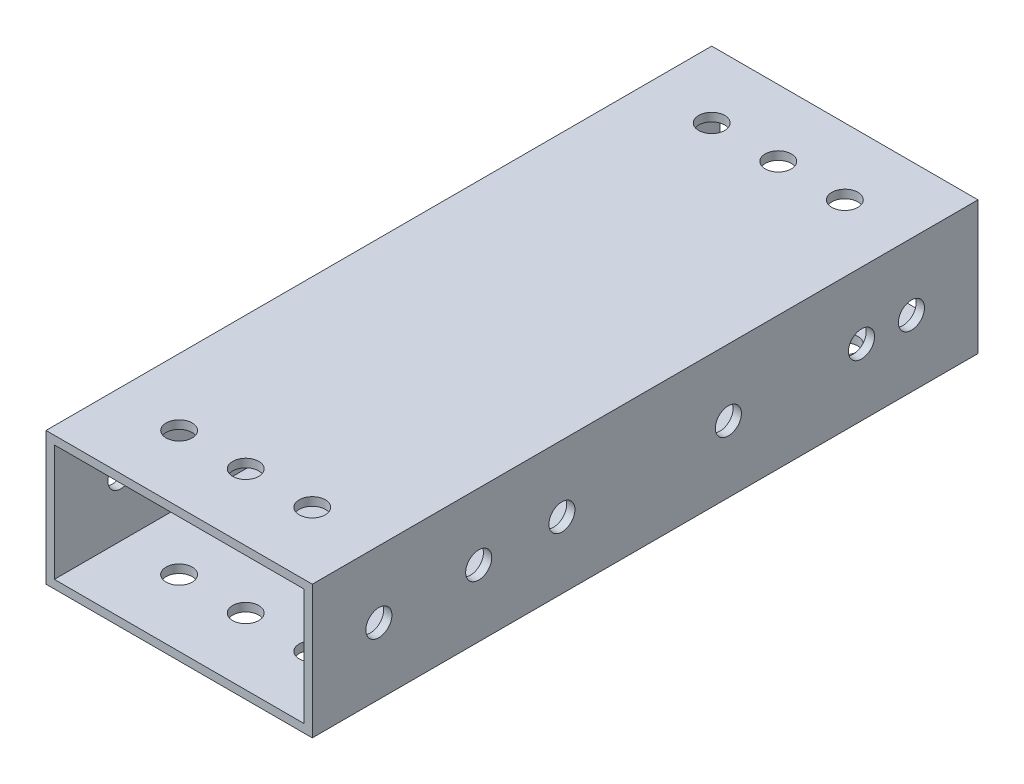
ISO-10303-21;
HEADER;
FILE_DESCRIPTION(('STEP AP214'),'2;1');
FILE_NAME('part.step','',(''),(''),'','','');
FILE_SCHEMA(('AUTOMOTIVE_DESIGN { 1 0 10303 214 1 1 1 1 }'));
ENDSEC;
DATA;
#1=APPLICATION_CONTEXT('core data for automotive mechanical design processes');
#2=APPLICATION_PROTOCOL_DEFINITION('international standard','automotive_design',2000,#1);
#3=PRODUCT_CONTEXT('',#1,'mechanical');
#4=PRODUCT('Part','Part','',(#3));
#5=PRODUCT_RELATED_PRODUCT_CATEGORY('part','',(#4));
#6=PRODUCT_DEFINITION_FORMATION('','',#4);
#7=PRODUCT_DEFINITION_CONTEXT('part definition',#1,'design');
#8=PRODUCT_DEFINITION('design','',#6,#7);
#9=PRODUCT_DEFINITION_SHAPE('','',#8);
#10=(LENGTH_UNIT() NAMED_UNIT(*) SI_UNIT(.MILLI.,.METRE.));
#11=(NAMED_UNIT(*) PLANE_ANGLE_UNIT() SI_UNIT($,.RADIAN.));
#12=(NAMED_UNIT(*) SI_UNIT($,.STERADIAN.) SOLID_ANGLE_UNIT());
#13=UNCERTAINTY_MEASURE_WITH_UNIT(LENGTH_MEASURE(1.E-05),#10,'distance_accuracy_value','');
#14=(GEOMETRIC_REPRESENTATION_CONTEXT(3) GLOBAL_UNCERTAINTY_ASSIGNED_CONTEXT((#13)) GLOBAL_UNIT_ASSIGNED_CONTEXT((#10,
#11,#12)) REPRESENTATION_CONTEXT('',''));
#15=CARTESIAN_POINT('',(0.,0.,0.));
#16=DIRECTION('',(0.,0.,1.));
#17=DIRECTION('',(1.,0.,0.));
#18=AXIS2_PLACEMENT_3D('',#15,#16,#17);
#19=CARTESIAN_POINT('',(0.,0.,63.5));
#20=DIRECTION('',(0.,0.,-1.));
#21=DIRECTION('',(-1.,0.,0.));
#22=AXIS2_PLACEMENT_3D('',#19,#20,#21);
#23=PLANE('',#22);
#24=DIRECTION('',(0.,1.,0.));
#25=VECTOR('',#24,1.);
#26=CARTESIAN_POINT('',(25.4,-12.7,63.5));
#27=LINE('',#26,#25);
#28=CARTESIAN_POINT('',(25.4,-12.7,63.5));
#29=VERTEX_POINT('',#28);
#30=CARTESIAN_POINT('',(25.4,12.7,63.5));
#31=VERTEX_POINT('',#30);
#32=EDGE_CURVE('E153',#29,#31,#27,.T.);
#33=ORIENTED_EDGE('',*,*,#32,.T.);
#34=DIRECTION('',(-1.,0.,0.));
#35=VECTOR('',#34,1.);
#36=CARTESIAN_POINT('',(-25.4,12.7,63.5));
#37=LINE('',#36,#35);
#38=CARTESIAN_POINT('',(-25.4,12.7,63.5));
#39=VERTEX_POINT('',#38);
#40=EDGE_CURVE('E156',#31,#39,#37,.T.);
#41=ORIENTED_EDGE('',*,*,#40,.T.);
#42=DIRECTION('',(0.,-1.,0.));
#43=VECTOR('',#42,1.);
#44=CARTESIAN_POINT('',(-25.4,-12.7,63.5));
#45=LINE('',#44,#43);
#46=CARTESIAN_POINT('',(-25.4,-12.7,63.5));
#47=VERTEX_POINT('',#46);
#48=EDGE_CURVE('E159',#39,#47,#45,.T.);
#49=ORIENTED_EDGE('',*,*,#48,.T.);
#50=DIRECTION('',(1.,0.,0.));
#51=VECTOR('',#50,1.);
#52=CARTESIAN_POINT('',(-25.4,-12.7,63.5));
#53=LINE('',#52,#51);
#54=EDGE_CURVE('E161',#47,#29,#53,.T.);
#55=ORIENTED_EDGE('',*,*,#54,.T.);
#56=EDGE_LOOP('',(#33,#41,#49,#55));
#57=FACE_BOUND('',#56,.T.);
#58=DIRECTION('',(0.,-1.,0.));
#59=VECTOR('',#58,1.);
#60=CARTESIAN_POINT('',(-23.8125,-11.1125,63.5));
#61=LINE('',#60,#59);
#62=CARTESIAN_POINT('',(-23.8125,11.1125,63.5));
#63=VERTEX_POINT('',#62);
#64=CARTESIAN_POINT('',(-23.8125,-11.1125,63.5));
#65=VERTEX_POINT('',#64);
#66=EDGE_CURVE('E115',#63,#65,#61,.T.);
#67=ORIENTED_EDGE('',*,*,#66,.F.);
#68=DIRECTION('',(-1.,0.,0.));
#69=VECTOR('',#68,1.);
#70=CARTESIAN_POINT('',(-23.8125,11.1125,63.5));
#71=LINE('',#70,#69);
#72=CARTESIAN_POINT('',(23.8125,11.1125,63.5));
#73=VERTEX_POINT('',#72);
#74=EDGE_CURVE('E137',#73,#63,#71,.T.);
#75=ORIENTED_EDGE('',*,*,#74,.F.);
#76=DIRECTION('',(0.,1.,0.));
#77=VECTOR('',#76,1.);
#78=CARTESIAN_POINT('',(23.8125,-11.1125,63.5));
#79=LINE('',#78,#77);
#80=CARTESIAN_POINT('',(23.8125,-11.1125,63.5));
#81=VERTEX_POINT('',#80);
#82=EDGE_CURVE('E135',#81,#73,#79,.T.);
#83=ORIENTED_EDGE('',*,*,#82,.F.);
#84=DIRECTION('',(1.,0.,0.));
#85=VECTOR('',#84,1.);
#86=CARTESIAN_POINT('',(-23.8125,-11.1125,63.5));
#87=LINE('',#86,#85);
#88=EDGE_CURVE('E123',#65,#81,#87,.T.);
#89=ORIENTED_EDGE('',*,*,#88,.F.);
#90=EDGE_LOOP('',(#67,#75,#83,#89));
#91=FACE_BOUND('',#90,.T.);
#92=ADVANCED_FACE('F48',(#57,#91),#23,.F.);
#93=CARTESIAN_POINT('',(0.,0.,-63.5));
#94=DIRECTION('',(0.,0.,-1.));
#95=DIRECTION('',(-1.,0.,0.));
#96=AXIS2_PLACEMENT_3D('',#93,#94,#95);
#97=PLANE('',#96);
#98=DIRECTION('',(0.,1.,0.));
#99=VECTOR('',#98,1.);
#100=CARTESIAN_POINT('',(25.4,-12.7,-63.5));
#101=LINE('',#100,#99);
#102=CARTESIAN_POINT('',(25.4,-12.7,-63.5));
#103=VERTEX_POINT('',#102);
#104=CARTESIAN_POINT('',(25.4,12.7,-63.5));
#105=VERTEX_POINT('',#104);
#106=EDGE_CURVE('E131',#103,#105,#101,.T.);
#107=ORIENTED_EDGE('',*,*,#106,.F.);
#108=DIRECTION('',(1.,0.,0.));
#109=VECTOR('',#108,1.);
#110=CARTESIAN_POINT('',(-25.4,-12.7,-63.5));
#111=LINE('',#110,#109);
#112=CARTESIAN_POINT('',(-25.4,-12.7,-63.5));
#113=VERTEX_POINT('',#112);
#114=EDGE_CURVE('E157',#113,#103,#111,.T.);
#115=ORIENTED_EDGE('',*,*,#114,.F.);
#116=DIRECTION('',(0.,-1.,0.));
#117=VECTOR('',#116,1.);
#118=CARTESIAN_POINT('',(-25.4,-12.7,-63.5));
#119=LINE('',#118,#117);
#120=CARTESIAN_POINT('',(-25.4,12.7,-63.5));
#121=VERTEX_POINT('',#120);
#122=EDGE_CURVE('E168',#121,#113,#119,.T.);
#123=ORIENTED_EDGE('',*,*,#122,.F.);
#124=DIRECTION('',(-1.,0.,0.));
#125=VECTOR('',#124,1.);
#126=CARTESIAN_POINT('',(-25.4,12.7,-63.5));
#127=LINE('',#126,#125);
#128=EDGE_CURVE('E166',#105,#121,#127,.T.);
#129=ORIENTED_EDGE('',*,*,#128,.F.);
#130=EDGE_LOOP('',(#107,#115,#123,#129));
#131=FACE_BOUND('',#130,.T.);
#132=DIRECTION('',(-1.,0.,0.));
#133=VECTOR('',#132,1.);
#134=CARTESIAN_POINT('',(-23.8125,11.1125,-63.5));
#135=LINE('',#134,#133);
#136=CARTESIAN_POINT('',(23.8125,11.1125,-63.5));
#137=VERTEX_POINT('',#136);
#138=CARTESIAN_POINT('',(-23.8125,11.1125,-63.5));
#139=VERTEX_POINT('',#138);
#140=EDGE_CURVE('E124',#137,#139,#135,.T.);
#141=ORIENTED_EDGE('',*,*,#140,.T.);
#142=DIRECTION('',(0.,-1.,0.));
#143=VECTOR('',#142,1.);
#144=CARTESIAN_POINT('',(-23.8125,-11.1125,-63.5));
#145=LINE('',#144,#143);
#146=CARTESIAN_POINT('',(-23.8125,-11.1125,-63.5));
#147=VERTEX_POINT('',#146);
#148=EDGE_CURVE('E73',#139,#147,#145,.T.);
#149=ORIENTED_EDGE('',*,*,#148,.T.);
#150=DIRECTION('',(1.,0.,0.));
#151=VECTOR('',#150,1.);
#152=CARTESIAN_POINT('',(-23.8125,-11.1125,-63.5));
#153=LINE('',#152,#151);
#154=CARTESIAN_POINT('',(23.8125,-11.1125,-63.5));
#155=VERTEX_POINT('',#154);
#156=EDGE_CURVE('E130',#147,#155,#153,.T.);
#157=ORIENTED_EDGE('',*,*,#156,.T.);
#158=DIRECTION('',(0.,1.,0.));
#159=VECTOR('',#158,1.);
#160=CARTESIAN_POINT('',(23.8125,-11.1125,-63.5));
#161=LINE('',#160,#159);
#162=EDGE_CURVE('E145',#155,#137,#161,.T.);
#163=ORIENTED_EDGE('',*,*,#162,.T.);
#164=EDGE_LOOP('',(#141,#149,#157,#163));
#165=FACE_BOUND('',#164,.T.);
#166=ADVANCED_FACE('F324',(#131,#165),#97,.T.);
#167=CARTESIAN_POINT('',(25.4,-12.7,63.5));
#168=DIRECTION('',(-1.,0.,0.));
#169=DIRECTION('',(0.,0.,1.));
#170=AXIS2_PLACEMENT_3D('',#167,#168,#169);
#171=PLANE('',#170);
#172=CARTESIAN_POINT('',(25.4,0.,50.8));
#173=DIRECTION('',(1.,0.,0.));
#174=DIRECTION('',(0.,0.,1.));
#175=AXIS2_PLACEMENT_3D('',#172,#173,#174);
#176=CIRCLE('',#175,2.4892);
#177=CARTESIAN_POINT('',(25.4,0.,53.2892));
#178=VERTEX_POINT('',#177);
#179=EDGE_CURVE('E425',#178,#178,#176,.T.);
#180=ORIENTED_EDGE('',*,*,#179,.F.);
#181=EDGE_LOOP('',(#180));
#182=FACE_BOUND('',#181,.T.);
#183=CARTESIAN_POINT('',(25.4,0.,-15.875));
#184=DIRECTION('',(1.,0.,0.));
#185=DIRECTION('',(0.,0.,-1.));
#186=AXIS2_PLACEMENT_3D('',#183,#184,#185);
#187=CIRCLE('',#186,2.4892);
#188=CARTESIAN_POINT('',(25.4,0.,-18.3642));
#189=VERTEX_POINT('',#188);
#190=EDGE_CURVE('E435',#189,#189,#187,.T.);
#191=ORIENTED_EDGE('',*,*,#190,.F.);
#192=EDGE_LOOP('',(#191));
#193=FACE_BOUND('',#192,.T.);
#194=CARTESIAN_POINT('',(25.4,0.,31.75));
#195=DIRECTION('',(1.,0.,0.));
#196=DIRECTION('',(0.,0.,-1.));
#197=AXIS2_PLACEMENT_3D('',#194,#195,#196);
#198=CIRCLE('',#197,2.4892);
#199=CARTESIAN_POINT('',(25.4,0.,29.2608));
#200=VERTEX_POINT('',#199);
#201=EDGE_CURVE('E452',#200,#200,#198,.T.);
#202=ORIENTED_EDGE('',*,*,#201,.F.);
#203=EDGE_LOOP('',(#202));
#204=FACE_BOUND('',#203,.T.);
#205=CARTESIAN_POINT('',(25.4,0.,-50.8));
#206=DIRECTION('',(1.,0.,0.));
#207=DIRECTION('',(0.,0.,-1.));
#208=AXIS2_PLACEMENT_3D('',#205,#206,#207);
#209=CIRCLE('',#208,2.4892);
#210=CARTESIAN_POINT('',(25.4,0.,-53.2892));
#211=VERTEX_POINT('',#210);
#212=EDGE_CURVE('E441',#211,#211,#209,.T.);
#213=ORIENTED_EDGE('',*,*,#212,.F.);
#214=EDGE_LOOP('',(#213));
#215=FACE_BOUND('',#214,.T.);
#216=CARTESIAN_POINT('',(25.4,0.,15.875));
#217=DIRECTION('',(1.,0.,0.));
#218=DIRECTION('',(0.,0.,-1.));
#219=AXIS2_PLACEMENT_3D('',#216,#217,#218);
#220=CIRCLE('',#219,2.4892);
#221=CARTESIAN_POINT('',(25.4,0.,13.3858));
#222=VERTEX_POINT('',#221);
#223=EDGE_CURVE('E442',#222,#222,#220,.T.);
#224=ORIENTED_EDGE('',*,*,#223,.F.);
#225=EDGE_LOOP('',(#224));
#226=FACE_BOUND('',#225,.T.);
#227=CARTESIAN_POINT('',(25.4,0.,-41.275));
#228=DIRECTION('',(1.,0.,0.));
#229=DIRECTION('',(0.,0.,-1.));
#230=AXIS2_PLACEMENT_3D('',#227,#228,#229);
#231=CIRCLE('',#230,2.4892);
#232=CARTESIAN_POINT('',(25.4,0.,-43.7642));
#233=VERTEX_POINT('',#232);
#234=EDGE_CURVE('E434',#233,#233,#231,.T.);
#235=ORIENTED_EDGE('',*,*,#234,.F.);
#236=EDGE_LOOP('',(#235));
#237=FACE_BOUND('',#236,.T.);
#238=ORIENTED_EDGE('',*,*,#106,.T.);
#239=DIRECTION('',(0.,0.,-1.));
#240=VECTOR('',#239,1.);
#241=CARTESIAN_POINT('',(25.4,12.7,63.5));
#242=LINE('',#241,#240);
#243=EDGE_CURVE('E13',#31,#105,#242,.T.);
#244=ORIENTED_EDGE('',*,*,#243,.F.);
#245=ORIENTED_EDGE('',*,*,#32,.F.);
#246=DIRECTION('',(0.,0.,-1.));
#247=VECTOR('',#246,1.);
#248=CARTESIAN_POINT('',(25.4,-12.7,63.5));
#249=LINE('',#248,#247);
#250=EDGE_CURVE('E163',#29,#103,#249,.T.);
#251=ORIENTED_EDGE('',*,*,#250,.T.);
#252=EDGE_LOOP('',(#238,#244,#245,#251));
#253=FACE_BOUND('',#252,.T.);
#254=ADVANCED_FACE('F50',(#182,#193,#204,#215,#226,#237,#253),#171,.F.);
#255=CARTESIAN_POINT('',(-25.4,12.7,63.5));
#256=DIRECTION('',(0.,-1.,0.));
#257=DIRECTION('',(0.,0.,-1.));
#258=AXIS2_PLACEMENT_3D('',#255,#256,#257);
#259=PLANE('',#258);
#260=CARTESIAN_POINT('',(-12.7,12.7,50.8));
#261=DIRECTION('',(0.,1.,0.));
#262=DIRECTION('',(0.,0.,-1.));
#263=AXIS2_PLACEMENT_3D('',#260,#261,#262);
#264=CIRCLE('',#263,2.4892);
#265=CARTESIAN_POINT('',(-12.7,12.7,48.3108));
#266=VERTEX_POINT('',#265);
#267=EDGE_CURVE('E235',#266,#266,#264,.T.);
#268=ORIENTED_EDGE('',*,*,#267,.F.);
#269=EDGE_LOOP('',(#268));
#270=FACE_BOUND('',#269,.T.);
#271=CARTESIAN_POINT('',(0.,12.7,50.8));
#272=DIRECTION('',(0.,1.,0.));
#273=DIRECTION('',(0.,0.,-1.));
#274=AXIS2_PLACEMENT_3D('',#271,#272,#273);
#275=CIRCLE('',#274,2.4892);
#276=CARTESIAN_POINT('',(0.,12.7,48.3108));
#277=VERTEX_POINT('',#276);
#278=EDGE_CURVE('E258',#277,#277,#275,.T.);
#279=ORIENTED_EDGE('',*,*,#278,.F.);
#280=EDGE_LOOP('',(#279));
#281=FACE_BOUND('',#280,.T.);
#282=CARTESIAN_POINT('',(12.7,12.7,50.8));
#283=DIRECTION('',(0.,1.,0.));
#284=DIRECTION('',(0.,0.,-1.));
#285=AXIS2_PLACEMENT_3D('',#282,#283,#284);
#286=CIRCLE('',#285,2.4892);
#287=CARTESIAN_POINT('',(12.7,12.7,48.3108));
#288=VERTEX_POINT('',#287);
#289=EDGE_CURVE('E252',#288,#288,#286,.T.);
#290=ORIENTED_EDGE('',*,*,#289,.F.);
#291=EDGE_LOOP('',(#290));
#292=FACE_BOUND('',#291,.T.);
#293=CARTESIAN_POINT('',(12.7,12.7,-50.8));
#294=DIRECTION('',(0.,1.,0.));
#295=DIRECTION('',(0.,0.,1.));
#296=AXIS2_PLACEMENT_3D('',#293,#294,#295);
#297=CIRCLE('',#296,2.4892);
#298=CARTESIAN_POINT('',(12.7,12.7,-48.3108));
#299=VERTEX_POINT('',#298);
#300=EDGE_CURVE('E246',#299,#299,#297,.T.);
#301=ORIENTED_EDGE('',*,*,#300,.F.);
#302=EDGE_LOOP('',(#301));
#303=FACE_BOUND('',#302,.T.);
#304=CARTESIAN_POINT('',(0.,12.7,-50.8));
#305=DIRECTION('',(0.,1.,0.));
#306=DIRECTION('',(0.,0.,1.));
#307=AXIS2_PLACEMENT_3D('',#304,#305,#306);
#308=CIRCLE('',#307,2.4892);
#309=CARTESIAN_POINT('',(0.,12.7,-48.3108));
#310=VERTEX_POINT('',#309);
#311=EDGE_CURVE('E240',#310,#310,#308,.T.);
#312=ORIENTED_EDGE('',*,*,#311,.F.);
#313=EDGE_LOOP('',(#312));
#314=FACE_BOUND('',#313,.T.);
#315=CARTESIAN_POINT('',(-12.7,12.7,-50.8));
#316=DIRECTION('',(0.,1.,0.));
#317=DIRECTION('',(0.,0.,1.));
#318=AXIS2_PLACEMENT_3D('',#315,#316,#317);
#319=CIRCLE('',#318,2.4892);
#320=CARTESIAN_POINT('',(-12.7,12.7,-48.3108));
#321=VERTEX_POINT('',#320);
#322=EDGE_CURVE('E239',#321,#321,#319,.T.);
#323=ORIENTED_EDGE('',*,*,#322,.F.);
#324=EDGE_LOOP('',(#323));
#325=FACE_BOUND('',#324,.T.);
#326=ORIENTED_EDGE('',*,*,#128,.T.);
#327=DIRECTION('',(0.,0.,-1.));
#328=VECTOR('',#327,1.);
#329=CARTESIAN_POINT('',(-25.4,12.7,63.5));
#330=LINE('',#329,#328);
#331=EDGE_CURVE('E57',#39,#121,#330,.T.);
#332=ORIENTED_EDGE('',*,*,#331,.F.);
#333=ORIENTED_EDGE('',*,*,#40,.F.);
#334=ORIENTED_EDGE('',*,*,#243,.T.);
#335=EDGE_LOOP('',(#326,#332,#333,#334));
#336=FACE_BOUND('',#335,.T.);
#337=ADVANCED_FACE('F328',(#270,#281,#292,#303,#314,#325,#336),#259,.F.);
#338=CARTESIAN_POINT('',(-25.4,-12.7,63.5));
#339=DIRECTION('',(1.,0.,0.));
#340=DIRECTION('',(0.,0.,-1.));
#341=AXIS2_PLACEMENT_3D('',#338,#339,#340);
#342=PLANE('',#341);
#343=CARTESIAN_POINT('',(-25.4,0.,50.8));
#344=DIRECTION('',(1.,0.,0.));
#345=DIRECTION('',(0.,0.,1.));
#346=AXIS2_PLACEMENT_3D('',#343,#344,#345);
#347=CIRCLE('',#346,2.4892);
#348=CARTESIAN_POINT('',(-25.4,0.,53.2892));
#349=VERTEX_POINT('',#348);
#350=EDGE_CURVE('E206',#349,#349,#347,.T.);
#351=ORIENTED_EDGE('',*,*,#350,.T.);
#352=EDGE_LOOP('',(#351));
#353=FACE_BOUND('',#352,.T.);
#354=CARTESIAN_POINT('',(-25.4,0.,-15.875));
#355=DIRECTION('',(1.,0.,0.));
#356=DIRECTION('',(0.,0.,-1.));
#357=AXIS2_PLACEMENT_3D('',#354,#355,#356);
#358=CIRCLE('',#357,2.4892);
#359=CARTESIAN_POINT('',(-25.4,0.,-18.3642));
#360=VERTEX_POINT('',#359);
#361=EDGE_CURVE('E431',#360,#360,#358,.T.);
#362=ORIENTED_EDGE('',*,*,#361,.T.);
#363=EDGE_LOOP('',(#362));
#364=FACE_BOUND('',#363,.T.);
#365=CARTESIAN_POINT('',(-25.4,0.,31.75));
#366=DIRECTION('',(1.,0.,0.));
#367=DIRECTION('',(0.,0.,-1.));
#368=AXIS2_PLACEMENT_3D('',#365,#366,#367);
#369=CIRCLE('',#368,2.4892);
#370=CARTESIAN_POINT('',(-25.4,0.,29.2608));
#371=VERTEX_POINT('',#370);
#372=EDGE_CURVE('E428',#371,#371,#369,.T.);
#373=ORIENTED_EDGE('',*,*,#372,.T.);
#374=EDGE_LOOP('',(#373));
#375=FACE_BOUND('',#374,.T.);
#376=CARTESIAN_POINT('',(-25.4,0.,-50.8));
#377=DIRECTION('',(1.,0.,0.));
#378=DIRECTION('',(0.,0.,-1.));
#379=AXIS2_PLACEMENT_3D('',#376,#377,#378);
#380=CIRCLE('',#379,2.4892);
#381=CARTESIAN_POINT('',(-25.4,0.,-53.2892));
#382=VERTEX_POINT('',#381);
#383=EDGE_CURVE('E455',#382,#382,#380,.T.);
#384=ORIENTED_EDGE('',*,*,#383,.T.);
#385=EDGE_LOOP('',(#384));
#386=FACE_BOUND('',#385,.T.);
#387=CARTESIAN_POINT('',(-25.4,0.,15.875));
#388=DIRECTION('',(1.,0.,0.));
#389=DIRECTION('',(0.,0.,-1.));
#390=AXIS2_PLACEMENT_3D('',#387,#388,#389);
#391=CIRCLE('',#390,2.4892);
#392=CARTESIAN_POINT('',(-25.4,0.,13.3858));
#393=VERTEX_POINT('',#392);
#394=EDGE_CURVE('E438',#393,#393,#391,.T.);
#395=ORIENTED_EDGE('',*,*,#394,.T.);
#396=EDGE_LOOP('',(#395));
#397=FACE_BOUND('',#396,.T.);
#398=CARTESIAN_POINT('',(-25.4,0.,-41.275));
#399=DIRECTION('',(1.,0.,0.));
#400=DIRECTION('',(0.,0.,-1.));
#401=AXIS2_PLACEMENT_3D('',#398,#399,#400);
#402=CIRCLE('',#401,2.4892);
#403=CARTESIAN_POINT('',(-25.4,0.,-43.7642));
#404=VERTEX_POINT('',#403);
#405=EDGE_CURVE('E445',#404,#404,#402,.T.);
#406=ORIENTED_EDGE('',*,*,#405,.T.);
#407=EDGE_LOOP('',(#406));
#408=FACE_BOUND('',#407,.T.);
#409=ORIENTED_EDGE('',*,*,#122,.T.);
#410=DIRECTION('',(0.,0.,-1.));
#411=VECTOR('',#410,1.);
#412=CARTESIAN_POINT('',(-25.4,-12.7,63.5));
#413=LINE('',#412,#411);
#414=EDGE_CURVE('E173',#47,#113,#413,.T.);
#415=ORIENTED_EDGE('',*,*,#414,.F.);
#416=ORIENTED_EDGE('',*,*,#48,.F.);
#417=ORIENTED_EDGE('',*,*,#331,.T.);
#418=EDGE_LOOP('',(#409,#415,#416,#417));
#419=FACE_BOUND('',#418,.T.);
#420=ADVANCED_FACE('F311',(#353,#364,#375,#386,#397,#408,#419),#342,.F.);
#421=CARTESIAN_POINT('',(-25.4,-12.7,63.5));
#422=DIRECTION('',(0.,1.,0.));
#423=DIRECTION('',(0.,0.,1.));
#424=AXIS2_PLACEMENT_3D('',#421,#422,#423);
#425=PLANE('',#424);
#426=CARTESIAN_POINT('',(-12.7,-12.7,50.8));
#427=DIRECTION('',(0.,1.,0.));
#428=DIRECTION('',(0.,0.,-1.));
#429=AXIS2_PLACEMENT_3D('',#426,#427,#428);
#430=CIRCLE('',#429,2.4892);
#431=CARTESIAN_POINT('',(-12.7,-12.7,48.3108));
#432=VERTEX_POINT('',#431);
#433=EDGE_CURVE('E261',#432,#432,#430,.T.);
#434=ORIENTED_EDGE('',*,*,#433,.T.);
#435=EDGE_LOOP('',(#434));
#436=FACE_BOUND('',#435,.T.);
#437=CARTESIAN_POINT('',(0.,-12.7,50.8));
#438=DIRECTION('',(0.,1.,0.));
#439=DIRECTION('',(0.,0.,-1.));
#440=AXIS2_PLACEMENT_3D('',#437,#438,#439);
#441=CIRCLE('',#440,2.4892);
#442=CARTESIAN_POINT('',(0.,-12.7,48.3108));
#443=VERTEX_POINT('',#442);
#444=EDGE_CURVE('E255',#443,#443,#441,.T.);
#445=ORIENTED_EDGE('',*,*,#444,.T.);
#446=EDGE_LOOP('',(#445));
#447=FACE_BOUND('',#446,.T.);
#448=CARTESIAN_POINT('',(12.7,-12.7,50.8));
#449=DIRECTION('',(0.,1.,0.));
#450=DIRECTION('',(0.,0.,-1.));
#451=AXIS2_PLACEMENT_3D('',#448,#449,#450);
#452=CIRCLE('',#451,2.4892);
#453=CARTESIAN_POINT('',(12.7,-12.7,48.3108));
#454=VERTEX_POINT('',#453);
#455=EDGE_CURVE('E249',#454,#454,#452,.T.);
#456=ORIENTED_EDGE('',*,*,#455,.T.);
#457=EDGE_LOOP('',(#456));
#458=FACE_BOUND('',#457,.T.);
#459=CARTESIAN_POINT('',(12.7,-12.7,-50.8));
#460=DIRECTION('',(0.,1.,0.));
#461=DIRECTION('',(0.,0.,1.));
#462=AXIS2_PLACEMENT_3D('',#459,#460,#461);
#463=CIRCLE('',#462,2.4892);
#464=CARTESIAN_POINT('',(12.7,-12.7,-48.3108));
#465=VERTEX_POINT('',#464);
#466=EDGE_CURVE('E243',#465,#465,#463,.T.);
#467=ORIENTED_EDGE('',*,*,#466,.T.);
#468=EDGE_LOOP('',(#467));
#469=FACE_BOUND('',#468,.T.);
#470=CARTESIAN_POINT('',(0.,-12.7,-50.8));
#471=DIRECTION('',(0.,1.,0.));
#472=DIRECTION('',(0.,0.,1.));
#473=AXIS2_PLACEMENT_3D('',#470,#471,#472);
#474=CIRCLE('',#473,2.4892);
#475=CARTESIAN_POINT('',(0.,-12.7,-48.3108));
#476=VERTEX_POINT('',#475);
#477=EDGE_CURVE('E236',#476,#476,#474,.T.);
#478=ORIENTED_EDGE('',*,*,#477,.T.);
#479=EDGE_LOOP('',(#478));
#480=FACE_BOUND('',#479,.T.);
#481=CARTESIAN_POINT('',(-12.7,-12.7,-50.8));
#482=DIRECTION('',(0.,1.,0.));
#483=DIRECTION('',(0.,0.,1.));
#484=AXIS2_PLACEMENT_3D('',#481,#482,#483);
#485=CIRCLE('',#484,2.4892);
#486=CARTESIAN_POINT('',(-12.7,-12.7,-48.3108));
#487=VERTEX_POINT('',#486);
#488=EDGE_CURVE('E182',#487,#487,#485,.T.);
#489=ORIENTED_EDGE('',*,*,#488,.T.);
#490=EDGE_LOOP('',(#489));
#491=FACE_BOUND('',#490,.T.);
#492=ORIENTED_EDGE('',*,*,#114,.T.);
#493=ORIENTED_EDGE('',*,*,#250,.F.);
#494=ORIENTED_EDGE('',*,*,#54,.F.);
#495=ORIENTED_EDGE('',*,*,#414,.T.);
#496=EDGE_LOOP('',(#492,#493,#494,#495));
#497=FACE_BOUND('',#496,.T.);
#498=ADVANCED_FACE('F308',(#436,#447,#458,#469,#480,#491,#497),#425,.F.);
#499=CARTESIAN_POINT('',(-23.8125,-11.1125,63.5));
#500=DIRECTION('',(1.,0.,0.));
#501=DIRECTION('',(0.,0.,-1.));
#502=AXIS2_PLACEMENT_3D('',#499,#500,#501);
#503=PLANE('',#502);
#504=CARTESIAN_POINT('',(-23.8125,0.,50.8));
#505=DIRECTION('',(1.,0.,0.));
#506=DIRECTION('',(0.,0.,-1.));
#507=AXIS2_PLACEMENT_3D('',#504,#505,#506);
#508=CIRCLE('',#507,2.4892);
#509=CARTESIAN_POINT('',(-23.8125,0.,48.3108));
#510=VERTEX_POINT('',#509);
#511=EDGE_CURVE('E232',#510,#510,#508,.T.);
#512=ORIENTED_EDGE('',*,*,#511,.F.);
#513=EDGE_LOOP('',(#512));
#514=FACE_BOUND('',#513,.T.);
#515=CARTESIAN_POINT('',(-23.8125,0.,-15.875));
#516=DIRECTION('',(1.,0.,0.));
#517=DIRECTION('',(0.,0.,-1.));
#518=AXIS2_PLACEMENT_3D('',#515,#516,#517);
#519=CIRCLE('',#518,2.4892);
#520=CARTESIAN_POINT('',(-23.8125,0.,-18.3642));
#521=VERTEX_POINT('',#520);
#522=EDGE_CURVE('E220',#521,#521,#519,.T.);
#523=ORIENTED_EDGE('',*,*,#522,.F.);
#524=EDGE_LOOP('',(#523));
#525=FACE_BOUND('',#524,.T.);
#526=CARTESIAN_POINT('',(-23.8125,0.,31.75));
#527=DIRECTION('',(1.,0.,0.));
#528=DIRECTION('',(0.,0.,-1.));
#529=AXIS2_PLACEMENT_3D('',#526,#527,#528);
#530=CIRCLE('',#529,2.4892);
#531=CARTESIAN_POINT('',(-23.8125,0.,29.2608));
#532=VERTEX_POINT('',#531);
#533=EDGE_CURVE('E217',#532,#532,#530,.T.);
#534=ORIENTED_EDGE('',*,*,#533,.F.);
#535=EDGE_LOOP('',(#534));
#536=FACE_BOUND('',#535,.T.);
#537=CARTESIAN_POINT('',(-23.8125,0.,-50.8));
#538=DIRECTION('',(1.,0.,0.));
#539=DIRECTION('',(0.,0.,-1.));
#540=AXIS2_PLACEMENT_3D('',#537,#538,#539);
#541=CIRCLE('',#540,2.4892);
#542=CARTESIAN_POINT('',(-23.8125,0.,-53.2892));
#543=VERTEX_POINT('',#542);
#544=EDGE_CURVE('E214',#543,#543,#541,.T.);
#545=ORIENTED_EDGE('',*,*,#544,.F.);
#546=EDGE_LOOP('',(#545));
#547=FACE_BOUND('',#546,.T.);
#548=CARTESIAN_POINT('',(-23.8125,0.,15.875));
#549=DIRECTION('',(1.,0.,0.));
#550=DIRECTION('',(0.,0.,-1.));
#551=AXIS2_PLACEMENT_3D('',#548,#549,#550);
#552=CIRCLE('',#551,2.4892);
#553=CARTESIAN_POINT('',(-23.8125,0.,13.3858));
#554=VERTEX_POINT('',#553);
#555=EDGE_CURVE('E210',#554,#554,#552,.T.);
#556=ORIENTED_EDGE('',*,*,#555,.F.);
#557=EDGE_LOOP('',(#556));
#558=FACE_BOUND('',#557,.T.);
#559=CARTESIAN_POINT('',(-23.8125,0.,-41.275));
#560=DIRECTION('',(1.,0.,0.));
#561=DIRECTION('',(0.,0.,-1.));
#562=AXIS2_PLACEMENT_3D('',#559,#560,#561);
#563=CIRCLE('',#562,2.4892);
#564=CARTESIAN_POINT('',(-23.8125,0.,-43.7642));
#565=VERTEX_POINT('',#564);
#566=EDGE_CURVE('E205',#565,#565,#563,.T.);
#567=ORIENTED_EDGE('',*,*,#566,.F.);
#568=EDGE_LOOP('',(#567));
#569=FACE_BOUND('',#568,.T.);
#570=ORIENTED_EDGE('',*,*,#148,.F.);
#571=DIRECTION('',(0.,0.,-1.));
#572=VECTOR('',#571,1.);
#573=CARTESIAN_POINT('',(-23.8125,11.1125,63.5));
#574=LINE('',#573,#572);
#575=EDGE_CURVE('E119',#63,#139,#574,.T.);
#576=ORIENTED_EDGE('',*,*,#575,.F.);
#577=ORIENTED_EDGE('',*,*,#66,.T.);
#578=DIRECTION('',(0.,0.,-1.));
#579=VECTOR('',#578,1.);
#580=CARTESIAN_POINT('',(-23.8125,-11.1125,63.5));
#581=LINE('',#580,#579);
#582=EDGE_CURVE('E118',#65,#147,#581,.T.);
#583=ORIENTED_EDGE('',*,*,#582,.T.);
#584=EDGE_LOOP('',(#570,#576,#577,#583));
#585=FACE_BOUND('',#584,.T.);
#586=ADVANCED_FACE('F117',(#514,#525,#536,#547,#558,#569,#585),#503,.T.);
#587=CARTESIAN_POINT('',(-23.8125,-11.1125,63.5));
#588=DIRECTION('',(0.,1.,0.));
#589=DIRECTION('',(0.,0.,1.));
#590=AXIS2_PLACEMENT_3D('',#587,#588,#589);
#591=PLANE('',#590);
#592=CARTESIAN_POINT('',(-12.7,-11.1125,50.8));
#593=DIRECTION('',(0.,1.,0.));
#594=DIRECTION('',(0.,0.,1.));
#595=AXIS2_PLACEMENT_3D('',#592,#593,#594);
#596=CIRCLE('',#595,2.4892);
#597=CARTESIAN_POINT('',(-12.7,-11.1125,53.2892));
#598=VERTEX_POINT('',#597);
#599=EDGE_CURVE('E143',#598,#598,#596,.T.);
#600=ORIENTED_EDGE('',*,*,#599,.F.);
#601=EDGE_LOOP('',(#600));
#602=FACE_BOUND('',#601,.T.);
#603=CARTESIAN_POINT('',(0.,-11.1125,50.8));
#604=DIRECTION('',(0.,1.,0.));
#605=DIRECTION('',(0.,0.,1.));
#606=AXIS2_PLACEMENT_3D('',#603,#604,#605);
#607=CIRCLE('',#606,2.4892);
#608=CARTESIAN_POINT('',(0.,-11.1125,53.2892));
#609=VERTEX_POINT('',#608);
#610=EDGE_CURVE('E198',#609,#609,#607,.T.);
#611=ORIENTED_EDGE('',*,*,#610,.F.);
#612=EDGE_LOOP('',(#611));
#613=FACE_BOUND('',#612,.T.);
#614=CARTESIAN_POINT('',(12.7,-11.1125,50.8));
#615=DIRECTION('',(0.,1.,0.));
#616=DIRECTION('',(0.,0.,1.));
#617=AXIS2_PLACEMENT_3D('',#614,#615,#616);
#618=CIRCLE('',#617,2.4892);
#619=CARTESIAN_POINT('',(12.7,-11.1125,53.2892));
#620=VERTEX_POINT('',#619);
#621=EDGE_CURVE('E194',#620,#620,#618,.T.);
#622=ORIENTED_EDGE('',*,*,#621,.F.);
#623=EDGE_LOOP('',(#622));
#624=FACE_BOUND('',#623,.T.);
#625=CARTESIAN_POINT('',(12.7,-11.1125,-50.8));
#626=DIRECTION('',(0.,1.,0.));
#627=DIRECTION('',(0.,0.,1.));
#628=AXIS2_PLACEMENT_3D('',#625,#626,#627);
#629=CIRCLE('',#628,2.4892);
#630=CARTESIAN_POINT('',(12.7,-11.1125,-48.3108));
#631=VERTEX_POINT('',#630);
#632=EDGE_CURVE('E190',#631,#631,#629,.T.);
#633=ORIENTED_EDGE('',*,*,#632,.F.);
#634=EDGE_LOOP('',(#633));
#635=FACE_BOUND('',#634,.T.);
#636=CARTESIAN_POINT('',(0.,-11.1125,-50.8));
#637=DIRECTION('',(0.,1.,0.));
#638=DIRECTION('',(0.,0.,1.));
#639=AXIS2_PLACEMENT_3D('',#636,#637,#638);
#640=CIRCLE('',#639,2.4892);
#641=CARTESIAN_POINT('',(0.,-11.1125,-48.3108));
#642=VERTEX_POINT('',#641);
#643=EDGE_CURVE('E186',#642,#642,#640,.T.);
#644=ORIENTED_EDGE('',*,*,#643,.F.);
#645=EDGE_LOOP('',(#644));
#646=FACE_BOUND('',#645,.T.);
#647=CARTESIAN_POINT('',(-12.7,-11.1125,-50.8));
#648=DIRECTION('',(0.,1.,0.));
#649=DIRECTION('',(0.,0.,1.));
#650=AXIS2_PLACEMENT_3D('',#647,#648,#649);
#651=CIRCLE('',#650,2.4892);
#652=CARTESIAN_POINT('',(-12.7,-11.1125,-48.3108));
#653=VERTEX_POINT('',#652);
#654=EDGE_CURVE('E181',#653,#653,#651,.T.);
#655=ORIENTED_EDGE('',*,*,#654,.F.);
#656=EDGE_LOOP('',(#655));
#657=FACE_BOUND('',#656,.T.);
#658=ORIENTED_EDGE('',*,*,#156,.F.);
#659=ORIENTED_EDGE('',*,*,#582,.F.);
#660=ORIENTED_EDGE('',*,*,#88,.T.);
#661=DIRECTION('',(0.,0.,-1.));
#662=VECTOR('',#661,1.);
#663=CARTESIAN_POINT('',(23.8125,-11.1125,63.5));
#664=LINE('',#663,#662);
#665=EDGE_CURVE('E132',#81,#155,#664,.T.);
#666=ORIENTED_EDGE('',*,*,#665,.T.);
#667=EDGE_LOOP('',(#658,#659,#660,#666));
#668=FACE_BOUND('',#667,.T.);
#669=ADVANCED_FACE('F127',(#602,#613,#624,#635,#646,#657,#668),#591,.T.);
#670=CARTESIAN_POINT('',(23.8125,-11.1125,63.5));
#671=DIRECTION('',(-1.,0.,0.));
#672=DIRECTION('',(0.,0.,1.));
#673=AXIS2_PLACEMENT_3D('',#670,#671,#672);
#674=PLANE('',#673);
#675=CARTESIAN_POINT('',(23.8125,0.,50.8));
#676=DIRECTION('',(-1.,0.,0.));
#677=DIRECTION('',(0.,0.,1.));
#678=AXIS2_PLACEMENT_3D('',#675,#676,#677);
#679=CIRCLE('',#678,2.4892);
#680=CARTESIAN_POINT('',(23.8125,0.,53.2892));
#681=VERTEX_POINT('',#680);
#682=EDGE_CURVE('E52',#681,#681,#679,.T.);
#683=ORIENTED_EDGE('',*,*,#682,.F.);
#684=EDGE_LOOP('',(#683));
#685=FACE_BOUND('',#684,.T.);
#686=CARTESIAN_POINT('',(23.8125,0.,-15.875));
#687=DIRECTION('',(-1.,0.,0.));
#688=DIRECTION('',(0.,0.,1.));
#689=AXIS2_PLACEMENT_3D('',#686,#687,#688);
#690=CIRCLE('',#689,2.4892);
#691=CARTESIAN_POINT('',(23.8125,0.,-13.3858));
#692=VERTEX_POINT('',#691);
#693=EDGE_CURVE('E218',#692,#692,#690,.T.);
#694=ORIENTED_EDGE('',*,*,#693,.F.);
#695=EDGE_LOOP('',(#694));
#696=FACE_BOUND('',#695,.T.);
#697=CARTESIAN_POINT('',(23.8125,0.,31.75));
#698=DIRECTION('',(-1.,0.,0.));
#699=DIRECTION('',(0.,0.,1.));
#700=AXIS2_PLACEMENT_3D('',#697,#698,#699);
#701=CIRCLE('',#700,2.4892);
#702=CARTESIAN_POINT('',(23.8125,0.,34.2392));
#703=VERTEX_POINT('',#702);
#704=EDGE_CURVE('E215',#703,#703,#701,.T.);
#705=ORIENTED_EDGE('',*,*,#704,.F.);
#706=EDGE_LOOP('',(#705));
#707=FACE_BOUND('',#706,.T.);
#708=CARTESIAN_POINT('',(23.8125,0.,-50.8));
#709=DIRECTION('',(-1.,0.,0.));
#710=DIRECTION('',(0.,0.,1.));
#711=AXIS2_PLACEMENT_3D('',#708,#709,#710);
#712=CIRCLE('',#711,2.4892);
#713=CARTESIAN_POINT('',(23.8125,0.,-48.3108));
#714=VERTEX_POINT('',#713);
#715=EDGE_CURVE('E211',#714,#714,#712,.T.);
#716=ORIENTED_EDGE('',*,*,#715,.F.);
#717=EDGE_LOOP('',(#716));
#718=FACE_BOUND('',#717,.T.);
#719=CARTESIAN_POINT('',(23.8125,0.,15.875));
#720=DIRECTION('',(-1.,0.,0.));
#721=DIRECTION('',(0.,0.,1.));
#722=AXIS2_PLACEMENT_3D('',#719,#720,#721);
#723=CIRCLE('',#722,2.4892);
#724=CARTESIAN_POINT('',(23.8125,0.,18.3642));
#725=VERTEX_POINT('',#724);
#726=EDGE_CURVE('E207',#725,#725,#723,.T.);
#727=ORIENTED_EDGE('',*,*,#726,.F.);
#728=EDGE_LOOP('',(#727));
#729=FACE_BOUND('',#728,.T.);
#730=CARTESIAN_POINT('',(23.8125,0.,-41.275));
#731=DIRECTION('',(-1.,0.,0.));
#732=DIRECTION('',(0.,0.,1.));
#733=AXIS2_PLACEMENT_3D('',#730,#731,#732);
#734=CIRCLE('',#733,2.4892);
#735=CARTESIAN_POINT('',(23.8125,0.,-38.7858));
#736=VERTEX_POINT('',#735);
#737=EDGE_CURVE('E202',#736,#736,#734,.T.);
#738=ORIENTED_EDGE('',*,*,#737,.F.);
#739=EDGE_LOOP('',(#738));
#740=FACE_BOUND('',#739,.T.);
#741=ORIENTED_EDGE('',*,*,#162,.F.);
#742=ORIENTED_EDGE('',*,*,#665,.F.);
#743=ORIENTED_EDGE('',*,*,#82,.T.);
#744=DIRECTION('',(0.,0.,-1.));
#745=VECTOR('',#744,1.);
#746=CARTESIAN_POINT('',(23.8125,11.1125,63.5));
#747=LINE('',#746,#745);
#748=EDGE_CURVE('E65',#73,#137,#747,.T.);
#749=ORIENTED_EDGE('',*,*,#748,.T.);
#750=EDGE_LOOP('',(#741,#742,#743,#749));
#751=FACE_BOUND('',#750,.T.);
#752=ADVANCED_FACE('F287',(#685,#696,#707,#718,#729,#740,#751),#674,.T.);
#753=CARTESIAN_POINT('',(-23.8125,11.1125,63.5));
#754=DIRECTION('',(0.,-1.,0.));
#755=DIRECTION('',(1.,0.,0.));
#756=AXIS2_PLACEMENT_3D('',#753,#754,#755);
#757=PLANE('',#756);
#758=CARTESIAN_POINT('',(-12.7,11.1125,50.8));
#759=DIRECTION('',(0.,-1.,0.));
#760=DIRECTION('',(1.,0.,0.));
#761=AXIS2_PLACEMENT_3D('',#758,#759,#760);
#762=CIRCLE('',#761,2.4892);
#763=CARTESIAN_POINT('',(-10.2108,11.1125,50.8));
#764=VERTEX_POINT('',#763);
#765=EDGE_CURVE('E199',#764,#764,#762,.T.);
#766=ORIENTED_EDGE('',*,*,#765,.F.);
#767=EDGE_LOOP('',(#766));
#768=FACE_BOUND('',#767,.T.);
#769=CARTESIAN_POINT('',(0.,11.1125,50.8));
#770=DIRECTION('',(0.,-1.,0.));
#771=DIRECTION('',(1.,0.,0.));
#772=AXIS2_PLACEMENT_3D('',#769,#770,#771);
#773=CIRCLE('',#772,2.4892);
#774=CARTESIAN_POINT('',(2.48920000000002,11.1125,50.8));
#775=VERTEX_POINT('',#774);
#776=EDGE_CURVE('E195',#775,#775,#773,.T.);
#777=ORIENTED_EDGE('',*,*,#776,.F.);
#778=EDGE_LOOP('',(#777));
#779=FACE_BOUND('',#778,.T.);
#780=CARTESIAN_POINT('',(12.7,11.1125,50.8));
#781=DIRECTION('',(0.,-1.,0.));
#782=DIRECTION('',(1.,0.,0.));
#783=AXIS2_PLACEMENT_3D('',#780,#781,#782);
#784=CIRCLE('',#783,2.4892);
#785=CARTESIAN_POINT('',(15.1892,11.1125,50.8));
#786=VERTEX_POINT('',#785);
#787=EDGE_CURVE('E191',#786,#786,#784,.T.);
#788=ORIENTED_EDGE('',*,*,#787,.F.);
#789=EDGE_LOOP('',(#788));
#790=FACE_BOUND('',#789,.T.);
#791=CARTESIAN_POINT('',(12.7,11.1125,-50.8));
#792=DIRECTION('',(0.,-1.,0.));
#793=DIRECTION('',(1.,0.,0.));
#794=AXIS2_PLACEMENT_3D('',#791,#792,#793);
#795=CIRCLE('',#794,2.4892);
#796=CARTESIAN_POINT('',(15.1892,11.1125,-50.8));
#797=VERTEX_POINT('',#796);
#798=EDGE_CURVE('E187',#797,#797,#795,.T.);
#799=ORIENTED_EDGE('',*,*,#798,.F.);
#800=EDGE_LOOP('',(#799));
#801=FACE_BOUND('',#800,.T.);
#802=CARTESIAN_POINT('',(0.,11.1125,-50.8));
#803=DIRECTION('',(0.,-1.,0.));
#804=DIRECTION('',(1.,0.,0.));
#805=AXIS2_PLACEMENT_3D('',#802,#803,#804);
#806=CIRCLE('',#805,2.4892);
#807=CARTESIAN_POINT('',(2.4892,11.1125,-50.8));
#808=VERTEX_POINT('',#807);
#809=EDGE_CURVE('E183',#808,#808,#806,.T.);
#810=ORIENTED_EDGE('',*,*,#809,.F.);
#811=EDGE_LOOP('',(#810));
#812=FACE_BOUND('',#811,.T.);
#813=CARTESIAN_POINT('',(-12.7,11.1125,-50.8));
#814=DIRECTION('',(0.,-1.,0.));
#815=DIRECTION('',(1.,0.,0.));
#816=AXIS2_PLACEMENT_3D('',#813,#814,#815);
#817=CIRCLE('',#816,2.4892);
#818=CARTESIAN_POINT('',(-10.2108,11.1125,-50.8));
#819=VERTEX_POINT('',#818);
#820=EDGE_CURVE('E178',#819,#819,#817,.T.);
#821=ORIENTED_EDGE('',*,*,#820,.F.);
#822=EDGE_LOOP('',(#821));
#823=FACE_BOUND('',#822,.T.);
#824=ORIENTED_EDGE('',*,*,#140,.F.);
#825=ORIENTED_EDGE('',*,*,#748,.F.);
#826=ORIENTED_EDGE('',*,*,#74,.T.);
#827=ORIENTED_EDGE('',*,*,#575,.T.);
#828=EDGE_LOOP('',(#824,#825,#826,#827));
#829=FACE_BOUND('',#828,.T.);
#830=ADVANCED_FACE('F353',(#768,#779,#790,#801,#812,#823,#829),#757,.T.);
#831=CARTESIAN_POINT('',(-12.7,-12.7,-50.8));
#832=DIRECTION('',(0.,1.,0.));
#833=DIRECTION('',(0.,0.,1.));
#834=AXIS2_PLACEMENT_3D('',#831,#832,#833);
#835=CYLINDRICAL_SURFACE('',#834,2.4892);
#836=ORIENTED_EDGE('',*,*,#820,.T.);
#837=EDGE_LOOP('',(#836));
#838=FACE_BOUND('',#837,.T.);
#839=ORIENTED_EDGE('',*,*,#322,.T.);
#840=EDGE_LOOP('',(#839));
#841=FACE_BOUND('',#840,.T.);
#842=ADVANCED_FACE('F305',(#838,#841),#835,.F.);
#843=CARTESIAN_POINT('',(0.,-12.7,-50.8));
#844=DIRECTION('',(0.,1.,0.));
#845=DIRECTION('',(0.,0.,1.));
#846=AXIS2_PLACEMENT_3D('',#843,#844,#845);
#847=CYLINDRICAL_SURFACE('',#846,2.4892);
#848=ORIENTED_EDGE('',*,*,#809,.T.);
#849=EDGE_LOOP('',(#848));
#850=FACE_BOUND('',#849,.T.);
#851=ORIENTED_EDGE('',*,*,#311,.T.);
#852=EDGE_LOOP('',(#851));
#853=FACE_BOUND('',#852,.T.);
#854=ADVANCED_FACE('F359',(#850,#853),#847,.F.);
#855=CARTESIAN_POINT('',(12.7,-12.7,-50.8));
#856=DIRECTION('',(0.,1.,0.));
#857=DIRECTION('',(0.,0.,1.));
#858=AXIS2_PLACEMENT_3D('',#855,#856,#857);
#859=CYLINDRICAL_SURFACE('',#858,2.4892);
#860=ORIENTED_EDGE('',*,*,#798,.T.);
#861=EDGE_LOOP('',(#860));
#862=FACE_BOUND('',#861,.T.);
#863=ORIENTED_EDGE('',*,*,#300,.T.);
#864=EDGE_LOOP('',(#863));
#865=FACE_BOUND('',#864,.T.);
#866=ADVANCED_FACE('F372',(#862,#865),#859,.F.);
#867=CARTESIAN_POINT('',(12.7,-12.7,50.8));
#868=DIRECTION('',(0.,1.,0.));
#869=DIRECTION('',(0.,0.,1.));
#870=AXIS2_PLACEMENT_3D('',#867,#868,#869);
#871=CYLINDRICAL_SURFACE('',#870,2.4892);
#872=ORIENTED_EDGE('',*,*,#787,.T.);
#873=EDGE_LOOP('',(#872));
#874=FACE_BOUND('',#873,.T.);
#875=ORIENTED_EDGE('',*,*,#289,.T.);
#876=EDGE_LOOP('',(#875));
#877=FACE_BOUND('',#876,.T.);
#878=ADVANCED_FACE('F367',(#874,#877),#871,.F.);
#879=CARTESIAN_POINT('',(0.,-12.7,50.8));
#880=DIRECTION('',(0.,1.,0.));
#881=DIRECTION('',(0.,0.,1.));
#882=AXIS2_PLACEMENT_3D('',#879,#880,#881);
#883=CYLINDRICAL_SURFACE('',#882,2.4892);
#884=ORIENTED_EDGE('',*,*,#776,.T.);
#885=EDGE_LOOP('',(#884));
#886=FACE_BOUND('',#885,.T.);
#887=ORIENTED_EDGE('',*,*,#278,.T.);
#888=EDGE_LOOP('',(#887));
#889=FACE_BOUND('',#888,.T.);
#890=ADVANCED_FACE('F363',(#886,#889),#883,.F.);
#891=CARTESIAN_POINT('',(-12.7,-12.7,50.8));
#892=DIRECTION('',(0.,1.,0.));
#893=DIRECTION('',(0.,0.,1.));
#894=AXIS2_PLACEMENT_3D('',#891,#892,#893);
#895=CYLINDRICAL_SURFACE('',#894,2.4892);
#896=ORIENTED_EDGE('',*,*,#765,.T.);
#897=EDGE_LOOP('',(#896));
#898=FACE_BOUND('',#897,.T.);
#899=ORIENTED_EDGE('',*,*,#267,.T.);
#900=EDGE_LOOP('',(#899));
#901=FACE_BOUND('',#900,.T.);
#902=ADVANCED_FACE('F303',(#898,#901),#895,.F.);
#903=ORIENTED_EDGE('',*,*,#654,.T.);
#904=EDGE_LOOP('',(#903));
#905=FACE_BOUND('',#904,.T.);
#906=ORIENTED_EDGE('',*,*,#488,.F.);
#907=EDGE_LOOP('',(#906));
#908=FACE_BOUND('',#907,.T.);
#909=ADVANCED_FACE('F299',(#905,#908),#835,.F.);
#910=ORIENTED_EDGE('',*,*,#643,.T.);
#911=EDGE_LOOP('',(#910));
#912=FACE_BOUND('',#911,.T.);
#913=ORIENTED_EDGE('',*,*,#477,.F.);
#914=EDGE_LOOP('',(#913));
#915=FACE_BOUND('',#914,.T.);
#916=ADVANCED_FACE('F302',(#912,#915),#847,.F.);
#917=ORIENTED_EDGE('',*,*,#632,.T.);
#918=EDGE_LOOP('',(#917));
#919=FACE_BOUND('',#918,.T.);
#920=ORIENTED_EDGE('',*,*,#466,.F.);
#921=EDGE_LOOP('',(#920));
#922=FACE_BOUND('',#921,.T.);
#923=ADVANCED_FACE('F378',(#919,#922),#859,.F.);
#924=ORIENTED_EDGE('',*,*,#621,.T.);
#925=EDGE_LOOP('',(#924));
#926=FACE_BOUND('',#925,.T.);
#927=ORIENTED_EDGE('',*,*,#455,.F.);
#928=EDGE_LOOP('',(#927));
#929=FACE_BOUND('',#928,.T.);
#930=ADVANCED_FACE('F374',(#926,#929),#871,.F.);
#931=ORIENTED_EDGE('',*,*,#610,.T.);
#932=EDGE_LOOP('',(#931));
#933=FACE_BOUND('',#932,.T.);
#934=ORIENTED_EDGE('',*,*,#444,.F.);
#935=EDGE_LOOP('',(#934));
#936=FACE_BOUND('',#935,.T.);
#937=ADVANCED_FACE('F369',(#933,#936),#883,.F.);
#938=ORIENTED_EDGE('',*,*,#599,.T.);
#939=EDGE_LOOP('',(#938));
#940=FACE_BOUND('',#939,.T.);
#941=ORIENTED_EDGE('',*,*,#433,.F.);
#942=EDGE_LOOP('',(#941));
#943=FACE_BOUND('',#942,.T.);
#944=ADVANCED_FACE('F282',(#940,#943),#895,.F.);
#945=CARTESIAN_POINT('',(-25.4,0.,-41.275));
#946=DIRECTION('',(1.,0.,0.));
#947=DIRECTION('',(0.,0.,-1.));
#948=AXIS2_PLACEMENT_3D('',#945,#946,#947);
#949=CYLINDRICAL_SURFACE('',#948,2.4892);
#950=ORIENTED_EDGE('',*,*,#737,.T.);
#951=EDGE_LOOP('',(#950));
#952=FACE_BOUND('',#951,.T.);
#953=ORIENTED_EDGE('',*,*,#234,.T.);
#954=EDGE_LOOP('',(#953));
#955=FACE_BOUND('',#954,.T.);
#956=ADVANCED_FACE('F394',(#952,#955),#949,.F.);
#957=CARTESIAN_POINT('',(-25.4,0.,15.875));
#958=DIRECTION('',(1.,0.,0.));
#959=DIRECTION('',(0.,0.,-1.));
#960=AXIS2_PLACEMENT_3D('',#957,#958,#959);
#961=CYLINDRICAL_SURFACE('',#960,2.4892);
#962=ORIENTED_EDGE('',*,*,#726,.T.);
#963=EDGE_LOOP('',(#962));
#964=FACE_BOUND('',#963,.T.);
#965=ORIENTED_EDGE('',*,*,#223,.T.);
#966=EDGE_LOOP('',(#965));
#967=FACE_BOUND('',#966,.T.);
#968=ADVANCED_FACE('F386',(#964,#967),#961,.F.);
#969=CARTESIAN_POINT('',(-25.4,0.,-50.8));
#970=DIRECTION('',(1.,0.,0.));
#971=DIRECTION('',(0.,0.,-1.));
#972=AXIS2_PLACEMENT_3D('',#969,#970,#971);
#973=CYLINDRICAL_SURFACE('',#972,2.4892);
#974=ORIENTED_EDGE('',*,*,#715,.T.);
#975=EDGE_LOOP('',(#974));
#976=FACE_BOUND('',#975,.T.);
#977=ORIENTED_EDGE('',*,*,#212,.T.);
#978=EDGE_LOOP('',(#977));
#979=FACE_BOUND('',#978,.T.);
#980=ADVANCED_FACE('F382',(#976,#979),#973,.F.);
#981=CARTESIAN_POINT('',(-25.4,0.,31.75));
#982=DIRECTION('',(1.,0.,0.));
#983=DIRECTION('',(0.,0.,-1.));
#984=AXIS2_PLACEMENT_3D('',#981,#982,#983);
#985=CYLINDRICAL_SURFACE('',#984,2.4892);
#986=ORIENTED_EDGE('',*,*,#704,.T.);
#987=EDGE_LOOP('',(#986));
#988=FACE_BOUND('',#987,.T.);
#989=ORIENTED_EDGE('',*,*,#201,.T.);
#990=EDGE_LOOP('',(#989));
#991=FACE_BOUND('',#990,.T.);
#992=ADVANCED_FACE('F385',(#988,#991),#985,.F.);
#993=CARTESIAN_POINT('',(-25.4,0.,-15.875));
#994=DIRECTION('',(1.,0.,0.));
#995=DIRECTION('',(0.,0.,-1.));
#996=AXIS2_PLACEMENT_3D('',#993,#994,#995);
#997=CYLINDRICAL_SURFACE('',#996,2.4892);
#998=ORIENTED_EDGE('',*,*,#693,.T.);
#999=EDGE_LOOP('',(#998));
#1000=FACE_BOUND('',#999,.T.);
#1001=ORIENTED_EDGE('',*,*,#190,.T.);
#1002=EDGE_LOOP('',(#1001));
#1003=FACE_BOUND('',#1002,.T.);
#1004=ADVANCED_FACE('F391',(#1000,#1003),#997,.F.);
#1005=CARTESIAN_POINT('',(-25.4,0.,50.8));
#1006=DIRECTION('',(1.,0.,0.));
#1007=DIRECTION('',(0.,0.,-1.));
#1008=AXIS2_PLACEMENT_3D('',#1005,#1006,#1007);
#1009=CYLINDRICAL_SURFACE('',#1008,2.4892);
#1010=ORIENTED_EDGE('',*,*,#682,.T.);
#1011=EDGE_LOOP('',(#1010));
#1012=FACE_BOUND('',#1011,.T.);
#1013=ORIENTED_EDGE('',*,*,#179,.T.);
#1014=EDGE_LOOP('',(#1013));
#1015=FACE_BOUND('',#1014,.T.);
#1016=ADVANCED_FACE('F405',(#1012,#1015),#1009,.F.);
#1017=ORIENTED_EDGE('',*,*,#566,.T.);
#1018=EDGE_LOOP('',(#1017));
#1019=FACE_BOUND('',#1018,.T.);
#1020=ORIENTED_EDGE('',*,*,#405,.F.);
#1021=EDGE_LOOP('',(#1020));
#1022=FACE_BOUND('',#1021,.T.);
#1023=ADVANCED_FACE('F398',(#1019,#1022),#949,.F.);
#1024=ORIENTED_EDGE('',*,*,#555,.T.);
#1025=EDGE_LOOP('',(#1024));
#1026=FACE_BOUND('',#1025,.T.);
#1027=ORIENTED_EDGE('',*,*,#394,.F.);
#1028=EDGE_LOOP('',(#1027));
#1029=FACE_BOUND('',#1028,.T.);
#1030=ADVANCED_FACE('F402',(#1026,#1029),#961,.F.);
#1031=ORIENTED_EDGE('',*,*,#544,.T.);
#1032=EDGE_LOOP('',(#1031));
#1033=FACE_BOUND('',#1032,.T.);
#1034=ORIENTED_EDGE('',*,*,#383,.F.);
#1035=EDGE_LOOP('',(#1034));
#1036=FACE_BOUND('',#1035,.T.);
#1037=ADVANCED_FACE('F388',(#1033,#1036),#973,.F.);
#1038=ORIENTED_EDGE('',*,*,#533,.T.);
#1039=EDGE_LOOP('',(#1038));
#1040=FACE_BOUND('',#1039,.T.);
#1041=ORIENTED_EDGE('',*,*,#372,.F.);
#1042=EDGE_LOOP('',(#1041));
#1043=FACE_BOUND('',#1042,.T.);
#1044=ADVANCED_FACE('F393',(#1040,#1043),#985,.F.);
#1045=ORIENTED_EDGE('',*,*,#522,.T.);
#1046=EDGE_LOOP('',(#1045));
#1047=FACE_BOUND('',#1046,.T.);
#1048=ORIENTED_EDGE('',*,*,#361,.F.);
#1049=EDGE_LOOP('',(#1048));
#1050=FACE_BOUND('',#1049,.T.);
#1051=ADVANCED_FACE('F406',(#1047,#1050),#997,.F.);
#1052=ORIENTED_EDGE('',*,*,#511,.T.);
#1053=EDGE_LOOP('',(#1052));
#1054=FACE_BOUND('',#1053,.T.);
#1055=ORIENTED_EDGE('',*,*,#350,.F.);
#1056=EDGE_LOOP('',(#1055));
#1057=FACE_BOUND('',#1056,.T.);
#1058=ADVANCED_FACE('F409',(#1054,#1057),#1009,.F.);
#1059=CLOSED_SHELL('',(#92,#166,#254,#337,#420,#498,#586,#669,#752,#830,#842,#854,#866,#878,
#890,#902,#909,#916,#923,#930,#937,#944,#956,#968,#980,#992,#1004,#1016,#1023,#1030,#1037,#1044,
#1051,#1058));
#1060=MANIFOLD_SOLID_BREP('B2',#1059);
#1061=ADVANCED_BREP_SHAPE_REPRESENTATION('',(#18,#1060),#14);
#1062=SHAPE_DEFINITION_REPRESENTATION(#9,#1061);
ENDSEC;
END-ISO-10303-21;
